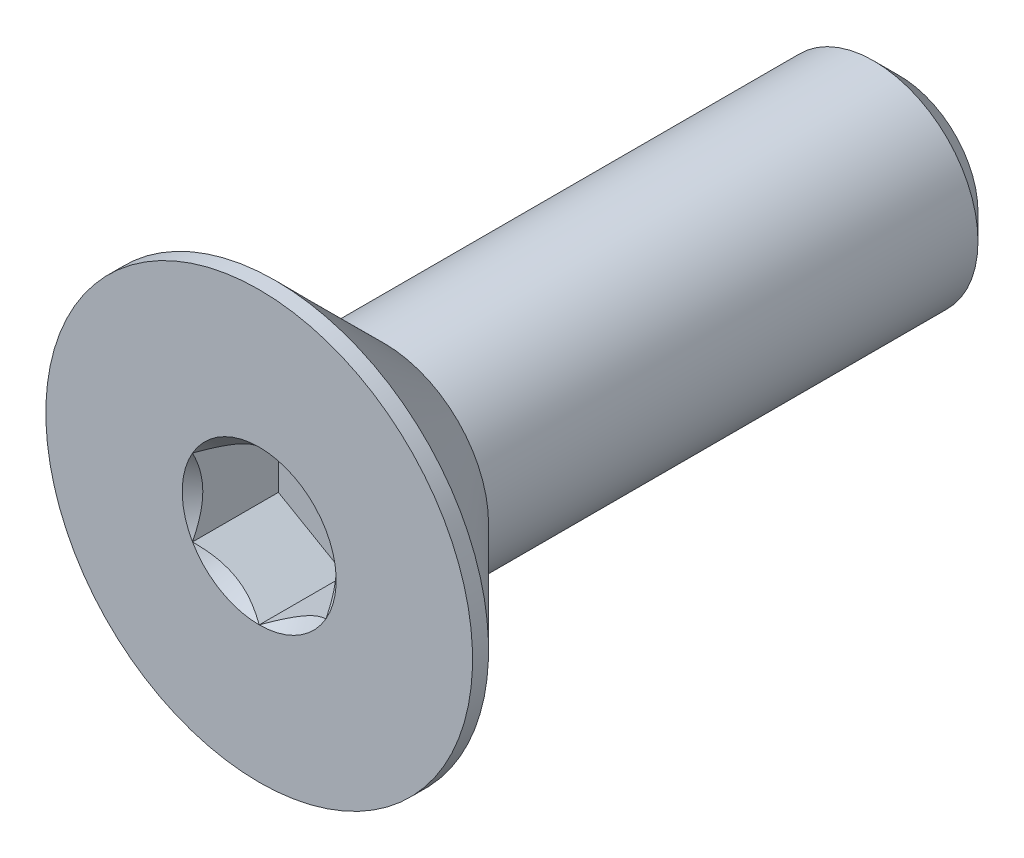
ISO-10303-21;
HEADER;
FILE_DESCRIPTION(('STEP AP214'),'2;1');
FILE_NAME('part.step','',(''),(''),'','','');
FILE_SCHEMA(('AUTOMOTIVE_DESIGN { 1 0 10303 214 1 1 1 1 }'));
ENDSEC;
DATA;
#1=APPLICATION_CONTEXT('core data for automotive mechanical design processes');
#2=APPLICATION_PROTOCOL_DEFINITION('international standard','automotive_design',2000,#1);
#3=PRODUCT_CONTEXT('',#1,'mechanical');
#4=PRODUCT('Part','Part','',(#3));
#5=PRODUCT_RELATED_PRODUCT_CATEGORY('part','',(#4));
#6=PRODUCT_DEFINITION_FORMATION('','',#4);
#7=PRODUCT_DEFINITION_CONTEXT('part definition',#1,'design');
#8=PRODUCT_DEFINITION('design','',#6,#7);
#9=PRODUCT_DEFINITION_SHAPE('','',#8);
#10=(LENGTH_UNIT() NAMED_UNIT(*) SI_UNIT(.MILLI.,.METRE.));
#11=(NAMED_UNIT(*) PLANE_ANGLE_UNIT() SI_UNIT($,.RADIAN.));
#12=(NAMED_UNIT(*) SI_UNIT($,.STERADIAN.) SOLID_ANGLE_UNIT());
#13=UNCERTAINTY_MEASURE_WITH_UNIT(LENGTH_MEASURE(1.E-05),#10,'distance_accuracy_value','');
#14=(GEOMETRIC_REPRESENTATION_CONTEXT(3) GLOBAL_UNCERTAINTY_ASSIGNED_CONTEXT((#13)) GLOBAL_UNIT_ASSIGNED_CONTEXT((#10,
#11,#12)) REPRESENTATION_CONTEXT('',''));
#15=CARTESIAN_POINT('',(0.,0.,0.));
#16=DIRECTION('',(0.,0.,1.));
#17=DIRECTION('',(1.,0.,0.));
#18=AXIS2_PLACEMENT_3D('',#15,#16,#17);
#19=CARTESIAN_POINT('',(1.25,-0.721687836487033,-1.61));
#20=DIRECTION('',(0.,0.,1.));
#21=DIRECTION('',(1.,0.,0.));
#22=AXIS2_PLACEMENT_3D('',#19,#20,#21);
#23=PLANE('',#22);
#24=DIRECTION('',(0.,-1.,0.));
#25=VECTOR('',#24,1.);
#26=CARTESIAN_POINT('',(-1.25,0.721687836487033,-1.61));
#27=LINE('',#26,#25);
#28=CARTESIAN_POINT('',(-1.25,0.721687836487032,-1.61));
#29=VERTEX_POINT('',#28);
#30=CARTESIAN_POINT('',(-1.25,-0.721687836487033,-1.61));
#31=VERTEX_POINT('',#30);
#32=EDGE_CURVE('E83',#29,#31,#27,.T.);
#33=ORIENTED_EDGE('',*,*,#32,.T.);
#34=DIRECTION('',(0.866025403784439,-0.5,0.));
#35=VECTOR('',#34,1.);
#36=CARTESIAN_POINT('',(-1.25,-0.721687836487033,-1.61));
#37=LINE('',#36,#35);
#38=CARTESIAN_POINT('',(0.,-1.44337567297406,-1.61));
#39=VERTEX_POINT('',#38);
#40=EDGE_CURVE('E85',#31,#39,#37,.T.);
#41=ORIENTED_EDGE('',*,*,#40,.T.);
#42=DIRECTION('',(0.866025403784439,0.5,0.));
#43=VECTOR('',#42,1.);
#44=CARTESIAN_POINT('',(0.,-1.44337567297406,-1.61));
#45=LINE('',#44,#43);
#46=CARTESIAN_POINT('',(1.25,-0.721687836487033,-1.61));
#47=VERTEX_POINT('',#46);
#48=EDGE_CURVE('E86',#39,#47,#45,.T.);
#49=ORIENTED_EDGE('',*,*,#48,.T.);
#50=DIRECTION('',(0.,1.,0.));
#51=VECTOR('',#50,1.);
#52=CARTESIAN_POINT('',(1.25,-0.721687836487033,-1.61));
#53=LINE('',#52,#51);
#54=CARTESIAN_POINT('',(1.25,0.721687836487033,-1.61));
#55=VERTEX_POINT('',#54);
#56=EDGE_CURVE('E72',#47,#55,#53,.T.);
#57=ORIENTED_EDGE('',*,*,#56,.T.);
#58=DIRECTION('',(-0.866025403784439,0.5,0.));
#59=VECTOR('',#58,1.);
#60=CARTESIAN_POINT('',(1.25,0.721687836487033,-1.61));
#61=LINE('',#60,#59);
#62=CARTESIAN_POINT('',(0.,1.44337567297406,-1.61));
#63=VERTEX_POINT('',#62);
#64=EDGE_CURVE('E111',#55,#63,#61,.T.);
#65=ORIENTED_EDGE('',*,*,#64,.T.);
#66=DIRECTION('',(-0.866025403784439,-0.5,0.));
#67=VECTOR('',#66,1.);
#68=CARTESIAN_POINT('',(0.,1.44337567297406,-1.61));
#69=LINE('',#68,#67);
#70=EDGE_CURVE('E116',#63,#29,#69,.T.);
#71=ORIENTED_EDGE('',*,*,#70,.T.);
#72=EDGE_LOOP('',(#33,#41,#49,#57,#65,#71));
#73=FACE_BOUND('',#72,.T.);
#74=ADVANCED_FACE('F17',(#73),#23,.T.);
#75=CARTESIAN_POINT('',(0.,-1.44337567297406,-1.61));
#76=DIRECTION('',(0.5,-0.866025403784439,0.));
#77=DIRECTION('',(0.866025403784439,0.5,0.));
#78=AXIS2_PLACEMENT_3D('',#75,#76,#77);
#79=PLANE('',#78);
#80=CARTESIAN_POINT('',(-1.59649597599891E-12,-1.44337567297499,-2.26828129064069E-12));
#81=CARTESIAN_POINT('',(0.0429631084916684,-1.41857091072118,-0.0247809602853259));
#82=CARTESIAN_POINT('',(0.0866445640224961,-1.39335141061186,-0.0481062505422107));
#83=CARTESIAN_POINT('',(0.175715534518587,-1.34192626181896,-0.0908138610995847));
#84=CARTESIAN_POINT('',(0.221113515509129,-1.3157157252734,-0.110172426663462));
#85=CARTESIAN_POINT('',(0.312656311401012,-1.26286346742285,-0.143333784117164));
#86=CARTESIAN_POINT('',(0.358777825771211,-1.23623519868579,-0.15721990325138));
#87=CARTESIAN_POINT('',(0.45203596100152,-1.18239258920645,-0.178614098245694));
#88=CARTESIAN_POINT('',(0.499169734949581,-1.15517989212961,-0.186138138130082));
#89=CARTESIAN_POINT('',(0.580409086338886,-1.1082763307362,-0.192927172266352));
#90=CARTESIAN_POINT('',(0.6144098218632,-1.0886459969286,-0.19393181141306));
#91=CARTESIAN_POINT('',(0.682351445146423,-1.04941988243685,-0.192236504858619));
#92=CARTESIAN_POINT('',(0.716292318027036,-1.02982411034269,-0.189535740825175));
#93=CARTESIAN_POINT('',(0.783846380048844,-0.99082175444955,-0.180585751756811));
#94=CARTESIAN_POINT('',(0.817459234875116,-0.97141536366737,-0.174333227052609));
#95=CARTESIAN_POINT('',(0.884123738991267,-0.932926594270518,-0.158616460881214));
#96=CARTESIAN_POINT('',(0.917175141068938,-0.91384435838388,-0.149150841277128));
#97=CARTESIAN_POINT('',(1.00178642984031,-0.864994008035247,-0.121071668556235));
#98=CARTESIAN_POINT('',(1.05281387539248,-0.835533298609642,-0.100350655055702));
#99=CARTESIAN_POINT('',(1.15287239429478,-0.777764485786684,-0.0536764942537951));
#100=CARTESIAN_POINT('',(1.20190935742265,-0.749452981924566,-0.0277403788128116));
#101=CARTESIAN_POINT('',(1.25000000000159,-0.721687836486111,-2.26875032062191E-12));
#102=B_SPLINE_CURVE_WITH_KNOTS('',3,(#80,#81,#82,#83,#84,#85,#86,#87,#88,#89,#90,#91,#92,#93,
#94,#95,#96,#97,#98,#99,#100,#101),.UNSPECIFIED.,.F.,.F.,(4,2,2,2,2,2,2,2,2,2,4),(0.,
0.166478683193945,0.333926926769032,0.498716658424013,0.663091654503518,0.780745575390527,
0.89842548413854,1.01621489951224,1.13405490022132,1.3211159162831,1.5075756576265),.UNSPECIFIED.);
#103=CARTESIAN_POINT('',(0.,-1.44337567297566,-1.59483068508603E-12));
#104=VERTEX_POINT('',#103);
#105=CARTESIAN_POINT('',(1.2500000000008,-0.721687836489763,-1.13438844846843E-12));
#106=VERTEX_POINT('',#105);
#107=EDGE_CURVE('E20',#104,#106,#102,.T.);
#108=ORIENTED_EDGE('',*,*,#107,.T.);
#109=DIRECTION('',(0.,0.,-1.));
#110=VECTOR('',#109,1.);
#111=CARTESIAN_POINT('',(1.25,-0.721687836487033,-1.61));
#112=LINE('',#111,#110);
#113=EDGE_CURVE('E91',#106,#47,#112,.T.);
#114=ORIENTED_EDGE('',*,*,#113,.T.);
#115=ORIENTED_EDGE('',*,*,#48,.F.);
#116=DIRECTION('',(0.,0.,1.));
#117=VECTOR('',#116,1.);
#118=CARTESIAN_POINT('',(0.,-1.44337567297406,-1.61));
#119=LINE('',#118,#117);
#120=EDGE_CURVE('E59',#39,#104,#119,.T.);
#121=ORIENTED_EDGE('',*,*,#120,.T.);
#122=EDGE_LOOP('',(#108,#114,#115,#121));
#123=FACE_BOUND('',#122,.T.);
#124=ADVANCED_FACE('F90',(#123),#79,.F.);
#125=CARTESIAN_POINT('',(-1.25,-0.721687836487033,-1.61));
#126=DIRECTION('',(-0.5,-0.866025403784439,0.));
#127=DIRECTION('',(0.866025403784439,-0.5,0.));
#128=AXIS2_PLACEMENT_3D('',#125,#126,#127);
#129=PLANE('',#128);
#130=CARTESIAN_POINT('',(-1.2500000000016,-0.721687836486111,-2.26821353053654E-12));
#131=CARTESIAN_POINT('',(-1.20703689150833,-0.746492598739921,-0.0247809602853259));
#132=CARTESIAN_POINT('',(-1.1633554359775,-0.771712098849239,-0.0481062505422108));
#133=CARTESIAN_POINT('',(-1.07428446548141,-0.823137247642138,-0.0908138610995846));
#134=CARTESIAN_POINT('',(-1.02888648449087,-0.849347784187693,-0.110172426663462));
#135=CARTESIAN_POINT('',(-0.937343688598987,-0.902200042038243,-0.143333784117164));
#136=CARTESIAN_POINT('',(-0.891222174228788,-0.92882831077531,-0.15721990325138));
#137=CARTESIAN_POINT('',(-0.79796403899848,-0.982670920254651,-0.178614098245694));
#138=CARTESIAN_POINT('',(-0.750830265050418,-1.00988361733149,-0.186138138130082));
#139=CARTESIAN_POINT('',(-0.669590913661113,-1.05678717872489,-0.192927172266351));
#140=CARTESIAN_POINT('',(-0.635590178136799,-1.0764175125325,-0.19393181141306));
#141=CARTESIAN_POINT('',(-0.567648554853576,-1.11564362702425,-0.192236504858619));
#142=CARTESIAN_POINT('',(-0.533707681972964,-1.1352393991184,-0.189535740825174));
#143=CARTESIAN_POINT('',(-0.466153619951155,-1.17424175501155,-0.180585751756811));
#144=CARTESIAN_POINT('',(-0.432540765124883,-1.19364814579373,-0.174333227052609));
#145=CARTESIAN_POINT('',(-0.365876261008733,-1.23213691519058,-0.158616460881213));
#146=CARTESIAN_POINT('',(-0.332824858931062,-1.25121915107722,-0.149150841277128));
#147=CARTESIAN_POINT('',(-0.24821357015969,-1.30006950142585,-0.121071668556235));
#148=CARTESIAN_POINT('',(-0.197186124607517,-1.32953021085146,-0.100350655055701));
#149=CARTESIAN_POINT('',(-0.0971276057052173,-1.38729902367441,-0.0536764942537947));
#150=CARTESIAN_POINT('',(-0.048090642577346,-1.41561052753653,-0.0277403788128112));
#151=CARTESIAN_POINT('',(1.59615448880655E-12,-1.44337567297499,-2.26815999688732E-12));
#152=B_SPLINE_CURVE_WITH_KNOTS('',3,(#130,#131,#132,#133,#134,#135,#136,#137,#138,#139,#140,
#141,#142,#143,#144,#145,#146,#147,#148,#149,#150,#151),.UNSPECIFIED.,.F.,.F.,(4,2,2,2,2,2,2,2,
2,2,4),(0.,0.166478683193946,0.333926926769032,0.498716658424013,0.663091654503517,
0.780745575390527,0.89842548413854,1.01621489951224,1.13405490022132,1.3211159162831,
1.5075756576265),.UNSPECIFIED.);
#153=CARTESIAN_POINT('',(-1.25000000000138,-0.721687836487831,-1.59402378566955E-12));
#154=VERTEX_POINT('',#153);
#155=EDGE_CURVE('E95',#154,#104,#152,.T.);
#156=ORIENTED_EDGE('',*,*,#155,.T.);
#157=ORIENTED_EDGE('',*,*,#120,.F.);
#158=ORIENTED_EDGE('',*,*,#40,.F.);
#159=DIRECTION('',(0.,0.,1.));
#160=VECTOR('',#159,1.);
#161=CARTESIAN_POINT('',(-1.25,-0.721687836487033,-1.61));
#162=LINE('',#161,#160);
#163=EDGE_CURVE('E97',#31,#154,#162,.T.);
#164=ORIENTED_EDGE('',*,*,#163,.T.);
#165=EDGE_LOOP('',(#156,#157,#158,#164));
#166=FACE_BOUND('',#165,.T.);
#167=ADVANCED_FACE('F93',(#166),#129,.F.);
#168=CARTESIAN_POINT('',(-1.25,0.721687836487033,-1.61));
#169=DIRECTION('',(-1.,0.,0.));
#170=DIRECTION('',(0.,-1.,0.));
#171=AXIS2_PLACEMENT_3D('',#168,#169,#170);
#172=PLANE('',#171);
#173=CARTESIAN_POINT('',(-1.25,0.721687836488875,-2.26706564801629E-12));
#174=CARTESIAN_POINT('',(-1.25,0.672078311968734,-0.0247809602843515));
#175=CARTESIAN_POINT('',(-1.25,0.621639311737501,-0.0481062505397474));
#176=CARTESIAN_POINT('',(-1.25,0.518789014126518,-0.0908138610927559));
#177=CARTESIAN_POINT('',(-1.25,0.466367941022824,-0.110172426653753));
#178=CARTESIAN_POINT('',(-1.25,0.360663425297222,-0.143333784099995));
#179=CARTESIAN_POINT('',(-1.25,0.307406887811172,-0.157219903229681));
#180=CARTESIAN_POINT('',(-1.25,0.199721668829271,-0.178614098213361));
#181=CARTESIAN_POINT('',(-1.25,0.145296274664291,-0.186138138091645));
#182=CARTESIAN_POINT('',(-1.25,0.0514891518512712,-0.192927172217058));
#183=CARTESIAN_POINT('',(-1.25,0.0122284842208853,-0.19393181135857));
#184=CARTESIAN_POINT('',(-1.25,-0.0662237447923836,-0.19223650479206));
#185=CARTESIAN_POINT('',(-1.25,-0.10541528899529,-0.189535740751741));
#186=CARTESIAN_POINT('',(-1.25,-0.183420000810115,-0.180585751668415));
#187=CARTESIAN_POINT('',(-1.25,-0.222232782388411,-0.174333226956124));
#188=CARTESIAN_POINT('',(-1.25,-0.29921032120936,-0.158616460767832));
#189=CARTESIAN_POINT('',(-1.25,-0.337374792995946,-0.14915084115494));
#190=CARTESIAN_POINT('',(-1.25,-0.435075493649191,-0.121071668433227));
#191=CARTESIAN_POINT('',(-1.25,-0.493996912445359,-0.100350654949516));
#192=CARTESIAN_POINT('',(-1.25,-0.609534537985814,-0.0536764941931677));
#193=CARTESIAN_POINT('',(-1.25,-0.666157545659632,-0.0277403787809129));
#194=CARTESIAN_POINT('',(-1.25,-0.721687836488875,-2.26700895969869E-12));
#195=B_SPLINE_CURVE_WITH_KNOTS('',3,(#173,#174,#175,#176,#177,#178,#179,#180,#181,#182,#183,
#184,#185,#186,#187,#188,#189,#190,#191,#192,#193,#194),.UNSPECIFIED.,.F.,.F.,(4,2,2,2,2,2,2,2,
2,2,4),(0.,0.166478683226287,0.333926926833723,0.498716658519756,0.663091654630285,
0.780745575562284,0.89842548435534,1.01621489977414,1.13405490052833,1.3211159164188,
1.50757565759031),.UNSPECIFIED.);
#196=CARTESIAN_POINT('',(-1.25000000000138,0.721687836487829,-1.5946106273097E-12));
#197=VERTEX_POINT('',#196);
#198=EDGE_CURVE('E195',#197,#154,#195,.T.);
#199=ORIENTED_EDGE('',*,*,#198,.T.);
#200=ORIENTED_EDGE('',*,*,#163,.F.);
#201=ORIENTED_EDGE('',*,*,#32,.F.);
#202=DIRECTION('',(0.,0.,1.));
#203=VECTOR('',#202,1.);
#204=CARTESIAN_POINT('',(-1.25,0.721687836487031,-1.61));
#205=LINE('',#204,#203);
#206=EDGE_CURVE('E113',#29,#197,#205,.T.);
#207=ORIENTED_EDGE('',*,*,#206,.T.);
#208=EDGE_LOOP('',(#199,#200,#201,#207));
#209=FACE_BOUND('',#208,.T.);
#210=ADVANCED_FACE('F205',(#209),#172,.F.);
#211=CARTESIAN_POINT('',(0.,1.44337567297406,-1.61));
#212=DIRECTION('',(-0.5,0.866025403784439,0.));
#213=DIRECTION('',(-0.866025403784439,-0.5,0.));
#214=AXIS2_PLACEMENT_3D('',#211,#212,#213);
#215=PLANE('',#214);
#216=CARTESIAN_POINT('',(1.59665500724298E-12,1.44337567297499,-2.26830697922971E-12));
#217=CARTESIAN_POINT('',(-0.0429631084916682,1.41857091072118,-0.024780960285326));
#218=CARTESIAN_POINT('',(-0.086644564022496,1.39335141061186,-0.0481062505422109));
#219=CARTESIAN_POINT('',(-0.175715534518587,1.34192626181896,-0.0908138610995848));
#220=CARTESIAN_POINT('',(-0.221113515509129,1.3157157252734,-0.110172426663462));
#221=CARTESIAN_POINT('',(-0.312656311401012,1.26286346742285,-0.143333784117164));
#222=CARTESIAN_POINT('',(-0.358777825771211,1.23623519868579,-0.15721990325138));
#223=CARTESIAN_POINT('',(-0.45203596100152,1.18239258920645,-0.178614098245694));
#224=CARTESIAN_POINT('',(-0.499169734949581,1.15517989212961,-0.186138138130082));
#225=CARTESIAN_POINT('',(-0.580409086338886,1.1082763307362,-0.192927172266352));
#226=CARTESIAN_POINT('',(-0.6144098218632,1.0886459969286,-0.19393181141306));
#227=CARTESIAN_POINT('',(-0.682351445146423,1.04941988243685,-0.192236504858619));
#228=CARTESIAN_POINT('',(-0.716292318027036,1.02982411034269,-0.189535740825175));
#229=CARTESIAN_POINT('',(-0.783846380048844,0.99082175444955,-0.180585751756811));
#230=CARTESIAN_POINT('',(-0.817459234875116,0.97141536366737,-0.174333227052609));
#231=CARTESIAN_POINT('',(-0.884123738991267,0.932926594270518,-0.158616460881214));
#232=CARTESIAN_POINT('',(-0.917175141068938,0.91384435838388,-0.149150841277128));
#233=CARTESIAN_POINT('',(-1.00178642984031,0.864994008035247,-0.121071668556235));
#234=CARTESIAN_POINT('',(-1.05281387539248,0.835533298609641,-0.100350655055702));
#235=CARTESIAN_POINT('',(-1.15287239429478,0.777764485786683,-0.0536764942537948));
#236=CARTESIAN_POINT('',(-1.20190935742265,0.749452981924565,-0.0277403788128113));
#237=CARTESIAN_POINT('',(-1.2500000000016,0.72168783648611,-2.26809894531069E-12));
#238=B_SPLINE_CURVE_WITH_KNOTS('',3,(#216,#217,#218,#219,#220,#221,#222,#223,#224,#225,#226,
#227,#228,#229,#230,#231,#232,#233,#234,#235,#236,#237),.UNSPECIFIED.,.F.,.F.,(4,2,2,2,2,2,2,2,
2,2,4),(0.,0.166478683193946,0.333926926769032,0.498716658424014,0.663091654503518,
0.780745575390527,0.898425484138541,1.01621489951224,1.13405490022132,1.3211159162831,
1.5075756576265),.UNSPECIFIED.);
#239=CARTESIAN_POINT('',(0.,1.44337567297566,-1.59483068508603E-12));
#240=VERTEX_POINT('',#239);
#241=EDGE_CURVE('E187',#240,#197,#238,.T.);
#242=ORIENTED_EDGE('',*,*,#241,.T.);
#243=ORIENTED_EDGE('',*,*,#206,.F.);
#244=ORIENTED_EDGE('',*,*,#70,.F.);
#245=DIRECTION('',(0.,0.,1.));
#246=VECTOR('',#245,1.);
#247=CARTESIAN_POINT('',(0.,1.44337567297406,-1.61));
#248=LINE('',#247,#246);
#249=EDGE_CURVE('E108',#63,#240,#248,.T.);
#250=ORIENTED_EDGE('',*,*,#249,.T.);
#251=EDGE_LOOP('',(#242,#243,#244,#250));
#252=FACE_BOUND('',#251,.T.);
#253=ADVANCED_FACE('F201',(#252),#215,.F.);
#254=CARTESIAN_POINT('',(1.25,0.721687836487033,-1.61));
#255=DIRECTION('',(0.5,0.866025403784439,0.));
#256=DIRECTION('',(-0.866025403784439,0.5,0.));
#257=AXIS2_PLACEMENT_3D('',#254,#255,#256);
#258=PLANE('',#257);
#259=CARTESIAN_POINT('',(1.2500000000016,0.721687836486112,-2.26853552184162E-12));
#260=CARTESIAN_POINT('',(1.20703689150833,0.746492598739921,-0.0247809602853261));
#261=CARTESIAN_POINT('',(1.1633554359775,0.771712098849239,-0.0481062505422109));
#262=CARTESIAN_POINT('',(1.07428446548141,0.823137247642138,-0.0908138610995848));
#263=CARTESIAN_POINT('',(1.02888648449087,0.849347784187694,-0.110172426663462));
#264=CARTESIAN_POINT('',(0.937343688598987,0.902200042038243,-0.143333784117164));
#265=CARTESIAN_POINT('',(0.891222174228788,0.92882831077531,-0.15721990325138));
#266=CARTESIAN_POINT('',(0.79796403899848,0.982670920254651,-0.178614098245694));
#267=CARTESIAN_POINT('',(0.750830265050418,1.00988361733149,-0.186138138130081));
#268=CARTESIAN_POINT('',(0.669590913661114,1.05678717872489,-0.192927172266351));
#269=CARTESIAN_POINT('',(0.6355901781368,1.0764175125325,-0.19393181141306));
#270=CARTESIAN_POINT('',(0.567648554853577,1.11564362702425,-0.192236504858619));
#271=CARTESIAN_POINT('',(0.533707681972964,1.1352393991184,-0.189535740825175));
#272=CARTESIAN_POINT('',(0.466153619951156,1.17424175501155,-0.180585751756811));
#273=CARTESIAN_POINT('',(0.432540765124884,1.19364814579373,-0.174333227052609));
#274=CARTESIAN_POINT('',(0.365876261008733,1.23213691519058,-0.158616460881213));
#275=CARTESIAN_POINT('',(0.332824858931062,1.25121915107722,-0.149150841277128));
#276=CARTESIAN_POINT('',(0.24821357015969,1.30006950142585,-0.121071668556235));
#277=CARTESIAN_POINT('',(0.197186124607517,1.32953021085146,-0.100350655055702));
#278=CARTESIAN_POINT('',(0.0971276057052176,1.38729902367441,-0.0536764942537948));
#279=CARTESIAN_POINT('',(0.0480906425773463,1.41561052753653,-0.0277403788128113));
#280=CARTESIAN_POINT('',(-1.59576689606698E-12,1.44337567297499,-2.26849473842903E-12));
#281=B_SPLINE_CURVE_WITH_KNOTS('',3,(#259,#260,#261,#262,#263,#264,#265,#266,#267,#268,#269,
#270,#271,#272,#273,#274,#275,#276,#277,#278,#279,#280),.UNSPECIFIED.,.F.,.F.,(4,2,2,2,2,2,2,2,
2,2,4),(0.,0.166478683193945,0.333926926769032,0.498716658424013,0.663091654503516,
0.780745575390525,0.898425484138539,1.01621489951224,1.13405490022132,1.32111591628309,
1.5075756576265),.UNSPECIFIED.);
#282=CARTESIAN_POINT('',(1.25000000000138,0.721687836487831,-1.5951241137448E-12));
#283=VERTEX_POINT('',#282);
#284=EDGE_CURVE('E157',#283,#240,#281,.T.);
#285=ORIENTED_EDGE('',*,*,#284,.T.);
#286=ORIENTED_EDGE('',*,*,#249,.F.);
#287=ORIENTED_EDGE('',*,*,#64,.F.);
#288=DIRECTION('',(0.,0.,-1.));
#289=VECTOR('',#288,1.);
#290=CARTESIAN_POINT('',(1.25,0.721687836487033,-1.61));
#291=LINE('',#290,#289);
#292=EDGE_CURVE('E40',#55,#283,#291,.F.);
#293=ORIENTED_EDGE('',*,*,#292,.T.);
#294=EDGE_LOOP('',(#285,#286,#287,#293));
#295=FACE_BOUND('',#294,.T.);
#296=ADVANCED_FACE('F204',(#295),#258,.F.);
#297=CARTESIAN_POINT('',(1.25,-0.721687836487033,-1.61));
#298=DIRECTION('',(1.,0.,0.));
#299=DIRECTION('',(0.,0.,-1.));
#300=AXIS2_PLACEMENT_3D('',#297,#298,#299);
#301=PLANE('',#300);
#302=CARTESIAN_POINT('',(1.25,-0.721687836488877,-2.26867496346261E-12));
#303=CARTESIAN_POINT('',(1.25,-0.672078311968736,-0.0247809602843534));
#304=CARTESIAN_POINT('',(1.25,-0.621639311737502,-0.0481062505397493));
#305=CARTESIAN_POINT('',(1.25,-0.51878901412652,-0.0908138610927579));
#306=CARTESIAN_POINT('',(1.25,-0.466367941022825,-0.110172426653755));
#307=CARTESIAN_POINT('',(1.25,-0.360663425297223,-0.143333784099997));
#308=CARTESIAN_POINT('',(1.25,-0.307406887811173,-0.157219903229684));
#309=CARTESIAN_POINT('',(1.25,-0.199721668829272,-0.178614098213363));
#310=CARTESIAN_POINT('',(1.25,-0.145296274664292,-0.186138138091648));
#311=CARTESIAN_POINT('',(1.25,-0.051489151851272,-0.19292717221706));
#312=CARTESIAN_POINT('',(1.25,-0.0122284842208862,-0.193931811358573));
#313=CARTESIAN_POINT('',(1.25,0.0662237447923825,-0.192236504792063));
#314=CARTESIAN_POINT('',(1.25,0.105415288995289,-0.189535740751744));
#315=CARTESIAN_POINT('',(1.25,0.183420000810113,-0.180585751668418));
#316=CARTESIAN_POINT('',(1.25,0.222232782388409,-0.174333226956127));
#317=CARTESIAN_POINT('',(1.25,0.299210321209359,-0.158616460767835));
#318=CARTESIAN_POINT('',(1.25,0.337374792995944,-0.149150841154943));
#319=CARTESIAN_POINT('',(1.25,0.435075493649189,-0.12107166843323));
#320=CARTESIAN_POINT('',(1.25,0.493996912445358,-0.100350654949519));
#321=CARTESIAN_POINT('',(1.25,0.609534537985814,-0.0536764941931699));
#322=CARTESIAN_POINT('',(1.25,0.666157545659632,-0.0277403787809148));
#323=CARTESIAN_POINT('',(1.25,0.721687836488876,-2.2687451820536E-12));
#324=B_SPLINE_CURVE_WITH_KNOTS('',3,(#302,#303,#304,#305,#306,#307,#308,#309,#310,#311,#312,
#313,#314,#315,#316,#317,#318,#319,#320,#321,#322,#323),.UNSPECIFIED.,.F.,.F.,(4,2,2,2,2,2,2,2,
2,2,4),(0.,0.166478683226287,0.333926926833724,0.498716658519757,0.663091654630287,
0.780745575562285,0.898425484355341,1.01621489977414,1.13405490052833,1.3211159164188,
1.50757565759032),.UNSPECIFIED.);
#325=EDGE_CURVE('E149',#106,#283,#324,.T.);
#326=ORIENTED_EDGE('',*,*,#325,.T.);
#327=ORIENTED_EDGE('',*,*,#292,.F.);
#328=ORIENTED_EDGE('',*,*,#56,.F.);
#329=ORIENTED_EDGE('',*,*,#113,.F.);
#330=EDGE_LOOP('',(#326,#327,#328,#329));
#331=FACE_BOUND('',#330,.T.);
#332=ADVANCED_FACE('F165',(#331),#301,.F.);
#333=CARTESIAN_POINT('',(0.,0.,-5.6843418860808E-11));
#334=DIRECTION('',(0.,0.,1.));
#335=DIRECTION('',(1.,0.,0.));
#336=AXIS2_PLACEMENT_3D('',#333,#334,#335);
#337=CONICAL_SURFACE('',#336,1.44337567292041,0.78539816325135);
#338=ORIENTED_EDGE('',*,*,#107,.F.);
#339=CARTESIAN_POINT('',(0.,0.,0.));
#340=DIRECTION('',(0.,0.,1.));
#341=DIRECTION('',(1.,0.,0.));
#342=AXIS2_PLACEMENT_3D('',#339,#340,#341);
#343=CIRCLE('',#342,1.44337567297725);
#344=EDGE_CURVE('E146',#106,#104,#343,.F.);
#345=ORIENTED_EDGE('',*,*,#344,.F.);
#346=EDGE_LOOP('',(#338,#345));
#347=FACE_BOUND('',#346,.T.);
#348=ADVANCED_FACE('F222',(#347),#337,.F.);
#349=CARTESIAN_POINT('',(0.,0.,-5.6843418860808E-11));
#350=DIRECTION('',(0.,0.,1.));
#351=DIRECTION('',(1.,0.,0.));
#352=AXIS2_PLACEMENT_3D('',#349,#350,#351);
#353=CONICAL_SURFACE('',#352,1.44337567292041,0.78539816325135);
#354=ORIENTED_EDGE('',*,*,#155,.F.);
#355=CARTESIAN_POINT('',(0.,0.,0.));
#356=DIRECTION('',(0.,0.,1.));
#357=DIRECTION('',(1.,0.,0.));
#358=AXIS2_PLACEMENT_3D('',#355,#356,#357);
#359=CIRCLE('',#358,1.44337567297725);
#360=EDGE_CURVE('E143',#104,#154,#359,.F.);
#361=ORIENTED_EDGE('',*,*,#360,.F.);
#362=EDGE_LOOP('',(#354,#361));
#363=FACE_BOUND('',#362,.T.);
#364=ADVANCED_FACE('F219',(#363),#353,.F.);
#365=CARTESIAN_POINT('',(0.,0.,-5.6843418860808E-11));
#366=DIRECTION('',(0.,0.,1.));
#367=DIRECTION('',(1.,0.,0.));
#368=AXIS2_PLACEMENT_3D('',#365,#366,#367);
#369=CONICAL_SURFACE('',#368,1.44337567292041,0.785398163397448);
#370=ORIENTED_EDGE('',*,*,#198,.F.);
#371=CARTESIAN_POINT('',(0.,0.,0.));
#372=DIRECTION('',(0.,0.,1.));
#373=DIRECTION('',(1.,0.,0.));
#374=AXIS2_PLACEMENT_3D('',#371,#372,#373);
#375=CIRCLE('',#374,1.44337567297725);
#376=EDGE_CURVE('E140',#154,#197,#375,.F.);
#377=ORIENTED_EDGE('',*,*,#376,.F.);
#378=EDGE_LOOP('',(#370,#377));
#379=FACE_BOUND('',#378,.T.);
#380=ADVANCED_FACE('F183',(#379),#369,.F.);
#381=CARTESIAN_POINT('',(0.,0.,-5.6843418860808E-11));
#382=DIRECTION('',(0.,0.,1.));
#383=DIRECTION('',(1.,0.,0.));
#384=AXIS2_PLACEMENT_3D('',#381,#382,#383);
#385=CONICAL_SURFACE('',#384,1.44337567292041,0.78539816325135);
#386=ORIENTED_EDGE('',*,*,#241,.F.);
#387=CARTESIAN_POINT('',(0.,0.,0.));
#388=DIRECTION('',(0.,0.,1.));
#389=DIRECTION('',(1.,0.,0.));
#390=AXIS2_PLACEMENT_3D('',#387,#388,#389);
#391=CIRCLE('',#390,1.44337567297725);
#392=EDGE_CURVE('E137',#197,#240,#391,.F.);
#393=ORIENTED_EDGE('',*,*,#392,.F.);
#394=EDGE_LOOP('',(#386,#393));
#395=FACE_BOUND('',#394,.T.);
#396=ADVANCED_FACE('F178',(#395),#385,.F.);
#397=CARTESIAN_POINT('',(0.,0.,-5.6843418860808E-11));
#398=DIRECTION('',(0.,0.,1.));
#399=DIRECTION('',(1.,0.,0.));
#400=AXIS2_PLACEMENT_3D('',#397,#398,#399);
#401=CONICAL_SURFACE('',#400,1.44337567292041,0.78539816325135);
#402=ORIENTED_EDGE('',*,*,#284,.F.);
#403=CARTESIAN_POINT('',(0.,0.,0.));
#404=DIRECTION('',(0.,0.,1.));
#405=DIRECTION('',(1.,0.,0.));
#406=AXIS2_PLACEMENT_3D('',#403,#404,#405);
#407=CIRCLE('',#406,1.44337567297725);
#408=EDGE_CURVE('E134',#240,#283,#407,.F.);
#409=ORIENTED_EDGE('',*,*,#408,.F.);
#410=EDGE_LOOP('',(#402,#409));
#411=FACE_BOUND('',#410,.T.);
#412=ADVANCED_FACE('F172',(#411),#401,.F.);
#413=CARTESIAN_POINT('',(0.,0.,-5.6843418860808E-11));
#414=DIRECTION('',(0.,0.,1.));
#415=DIRECTION('',(1.,0.,0.));
#416=AXIS2_PLACEMENT_3D('',#413,#414,#415);
#417=CONICAL_SURFACE('',#416,1.44337567292041,0.785398163397448);
#418=CARTESIAN_POINT('',(0.,0.,0.));
#419=DIRECTION('',(0.,0.,1.));
#420=DIRECTION('',(1.,0.,0.));
#421=AXIS2_PLACEMENT_3D('',#418,#419,#420);
#422=CIRCLE('',#421,1.44337567297725);
#423=EDGE_CURVE('E131',#283,#106,#422,.F.);
#424=ORIENTED_EDGE('',*,*,#423,.F.);
#425=ORIENTED_EDGE('',*,*,#325,.F.);
#426=EDGE_LOOP('',(#424,#425));
#427=FACE_BOUND('',#426,.T.);
#428=ADVANCED_FACE('F167',(#427),#417,.F.);
#429=CARTESIAN_POINT('',(0.,-2.,0.));
#430=DIRECTION('',(0.,0.,1.));
#431=DIRECTION('',(0.,-1.,0.));
#432=AXIS2_PLACEMENT_3D('',#429,#430,#431);
#433=PLANE('',#432);
#434=ORIENTED_EDGE('',*,*,#408,.T.);
#435=ORIENTED_EDGE('',*,*,#423,.T.);
#436=ORIENTED_EDGE('',*,*,#344,.T.);
#437=ORIENTED_EDGE('',*,*,#360,.T.);
#438=ORIENTED_EDGE('',*,*,#376,.T.);
#439=ORIENTED_EDGE('',*,*,#392,.T.);
#440=EDGE_LOOP('',(#434,#435,#436,#437,#438,#439));
#441=FACE_BOUND('',#440,.T.);
#442=CARTESIAN_POINT('',(0.,0.,0.));
#443=DIRECTION('',(0.,0.,1.));
#444=DIRECTION('',(0.,-1.,0.));
#445=AXIS2_PLACEMENT_3D('',#442,#443,#444);
#446=CIRCLE('',#445,4.);
#447=CARTESIAN_POINT('',(0.,-4.,0.));
#448=VERTEX_POINT('',#447);
#449=EDGE_CURVE('E128',#448,#448,#446,.F.);
#450=ORIENTED_EDGE('',*,*,#449,.F.);
#451=EDGE_LOOP('',(#450));
#452=FACE_BOUND('',#451,.T.);
#453=ADVANCED_FACE('F171',(#441,#452),#433,.T.);
#454=CARTESIAN_POINT('',(0.,-2.,-12.));
#455=DIRECTION('',(0.,0.,-1.));
#456=DIRECTION('',(0.,1.,0.));
#457=AXIS2_PLACEMENT_3D('',#454,#455,#456);
#458=PLANE('',#457);
#459=CARTESIAN_POINT('',(0.,0.,-12.0000000000005));
#460=DIRECTION('',(0.,0.,1.));
#461=DIRECTION('',(1.,0.,0.));
#462=AXIS2_PLACEMENT_3D('',#459,#460,#461);
#463=CIRCLE('',#462,1.47499999997081);
#464=CARTESIAN_POINT('',(1.47499999997081,0.,-12.0000000000005));
#465=VERTEX_POINT('',#464);
#466=EDGE_CURVE('E124',#465,#465,#463,.T.);
#467=ORIENTED_EDGE('',*,*,#466,.F.);
#468=EDGE_LOOP('',(#467));
#469=FACE_BOUND('',#468,.T.);
#470=ADVANCED_FACE('F250',(#469),#458,.T.);
#471=CARTESIAN_POINT('',(0.,0.,0.));
#472=DIRECTION('',(0.,0.,1.));
#473=DIRECTION('',(0.,-1.,0.));
#474=AXIS2_PLACEMENT_3D('',#471,#472,#473);
#475=CYLINDRICAL_SURFACE('',#474,4.);
#476=CARTESIAN_POINT('',(0.,0.,-0.29999999998154));
#477=DIRECTION('',(0.,0.,1.));
#478=DIRECTION('',(0.,-1.,0.));
#479=AXIS2_PLACEMENT_3D('',#476,#477,#478);
#480=CIRCLE('',#479,4.0000000000191);
#481=CARTESIAN_POINT('',(0.,-4.0000000000191,-0.299999999981537));
#482=VERTEX_POINT('',#481);
#483=EDGE_CURVE('E127',#482,#482,#480,.F.);
#484=ORIENTED_EDGE('',*,*,#483,.F.);
#485=EDGE_LOOP('',(#484));
#486=FACE_BOUND('',#485,.T.);
#487=ORIENTED_EDGE('',*,*,#449,.T.);
#488=EDGE_LOOP('',(#487));
#489=FACE_BOUND('',#488,.T.);
#490=ADVANCED_FACE('F247',(#486,#489),#475,.T.);
#491=CARTESIAN_POINT('',(0.,0.,-11.5210000000161));
#492=DIRECTION('',(0.,0.,1.));
#493=DIRECTION('',(1.,0.,0.));
#494=AXIS2_PLACEMENT_3D('',#491,#492,#493);
#495=CONICAL_SURFACE('',#494,1.95399999995516,0.785398163397448);
#496=ORIENTED_EDGE('',*,*,#466,.T.);
#497=EDGE_LOOP('',(#496));
#498=FACE_BOUND('',#497,.T.);
#499=CARTESIAN_POINT('',(0.,0.,-11.521));
#500=DIRECTION('',(0.,0.,-1.));
#501=DIRECTION('',(0.,1.,0.));
#502=AXIS2_PLACEMENT_3D('',#499,#500,#501);
#503=CIRCLE('',#502,1.954);
#504=CARTESIAN_POINT('',(0.,1.954,-11.521));
#505=VERTEX_POINT('',#504);
#506=EDGE_CURVE('E31',#505,#505,#503,.F.);
#507=ORIENTED_EDGE('',*,*,#506,.F.);
#508=EDGE_LOOP('',(#507));
#509=FACE_BOUND('',#508,.T.);
#510=ADVANCED_FACE('F240',(#498,#509),#495,.T.);
#511=CARTESIAN_POINT('',(0.,0.,-0.300000000038384));
#512=DIRECTION('',(0.,0.,1.));
#513=DIRECTION('',(0.,-1.,0.));
#514=AXIS2_PLACEMENT_3D('',#511,#512,#513);
#515=CONICAL_SURFACE('',#514,3.99999999990541,0.785398163397449);
#516=CARTESIAN_POINT('',(0.,0.,-2.346));
#517=DIRECTION('',(0.,0.,-1.));
#518=DIRECTION('',(0.,1.,0.));
#519=AXIS2_PLACEMENT_3D('',#516,#517,#518);
#520=CIRCLE('',#519,1.954);
#521=CARTESIAN_POINT('',(0.,1.954,-2.346));
#522=VERTEX_POINT('',#521);
#523=EDGE_CURVE('E11',#522,#522,#520,.T.);
#524=ORIENTED_EDGE('',*,*,#523,.F.);
#525=EDGE_LOOP('',(#524));
#526=FACE_BOUND('',#525,.T.);
#527=ORIENTED_EDGE('',*,*,#483,.T.);
#528=EDGE_LOOP('',(#527));
#529=FACE_BOUND('',#528,.T.);
#530=ADVANCED_FACE('F234',(#526,#529),#515,.T.);
#531=CARTESIAN_POINT('',(0.,0.,-12.));
#532=DIRECTION('',(0.,0.,-1.));
#533=DIRECTION('',(0.,1.,0.));
#534=AXIS2_PLACEMENT_3D('',#531,#532,#533);
#535=CYLINDRICAL_SURFACE('',#534,1.954);
#536=ORIENTED_EDGE('',*,*,#523,.T.);
#537=EDGE_LOOP('',(#536));
#538=FACE_BOUND('',#537,.T.);
#539=ORIENTED_EDGE('',*,*,#506,.T.);
#540=EDGE_LOOP('',(#539));
#541=FACE_BOUND('',#540,.T.);
#542=ADVANCED_FACE('F232',(#538,#541),#535,.T.);
#543=CLOSED_SHELL('',(#74,#124,#167,#210,#253,#296,#332,#348,#364,#380,#396,#412,#428,#453,#470,
#490,#510,#530,#542));
#544=MANIFOLD_SOLID_BREP('B1',#543);
#545=ADVANCED_BREP_SHAPE_REPRESENTATION('',(#18,#544),#14);
#546=SHAPE_DEFINITION_REPRESENTATION(#9,#545);
ENDSEC;
END-ISO-10303-21;
